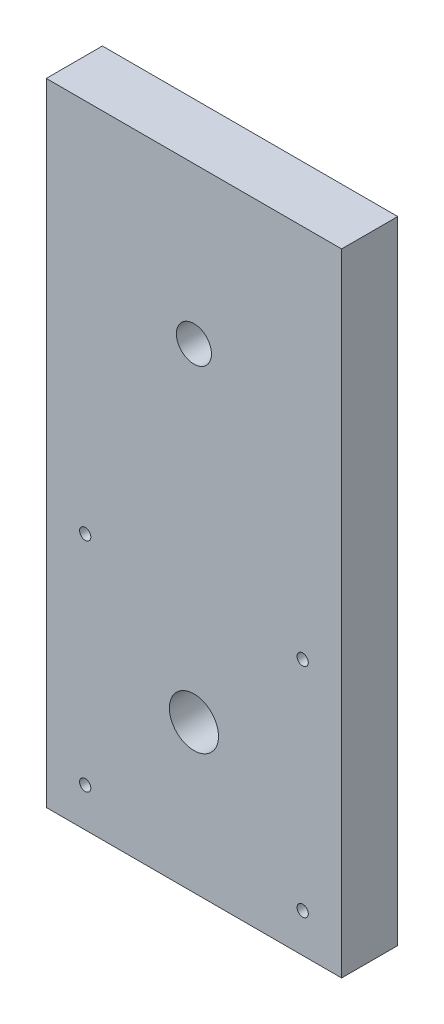
ISO-10303-21;
HEADER;
FILE_DESCRIPTION(('STEP AP214'),'2;1');
FILE_NAME('part.step','',(''),(''),'','','');
FILE_SCHEMA(('AUTOMOTIVE_DESIGN { 1 0 10303 214 1 1 1 1 }'));
ENDSEC;
DATA;
#1=APPLICATION_CONTEXT('core data for automotive mechanical design processes');
#2=APPLICATION_PROTOCOL_DEFINITION('international standard','automotive_design',2000,#1);
#3=PRODUCT_CONTEXT('',#1,'mechanical');
#4=PRODUCT('Part','Part','',(#3));
#5=PRODUCT_RELATED_PRODUCT_CATEGORY('part','',(#4));
#6=PRODUCT_DEFINITION_FORMATION('','',#4);
#7=PRODUCT_DEFINITION_CONTEXT('part definition',#1,'design');
#8=PRODUCT_DEFINITION('design','',#6,#7);
#9=PRODUCT_DEFINITION_SHAPE('','',#8);
#10=(LENGTH_UNIT() NAMED_UNIT(*) SI_UNIT(.MILLI.,.METRE.));
#11=(NAMED_UNIT(*) PLANE_ANGLE_UNIT() SI_UNIT($,.RADIAN.));
#12=(NAMED_UNIT(*) SI_UNIT($,.STERADIAN.) SOLID_ANGLE_UNIT());
#13=UNCERTAINTY_MEASURE_WITH_UNIT(LENGTH_MEASURE(1.E-05),#10,'distance_accuracy_value','');
#14=(GEOMETRIC_REPRESENTATION_CONTEXT(3) GLOBAL_UNCERTAINTY_ASSIGNED_CONTEXT((#13)) GLOBAL_UNIT_ASSIGNED_CONTEXT((#10,
#11,#12)) REPRESENTATION_CONTEXT('',''));
#15=CARTESIAN_POINT('',(0.,0.,0.));
#16=DIRECTION('',(0.,0.,1.));
#17=DIRECTION('',(1.,0.,0.));
#18=AXIS2_PLACEMENT_3D('',#15,#16,#17);
#19=CARTESIAN_POINT('',(0.,0.,0.));
#20=DIRECTION('',(0.,0.,-1.));
#21=DIRECTION('',(-1.,0.,0.));
#22=AXIS2_PLACEMENT_3D('',#19,#20,#21);
#23=PLANE('',#22);
#24=CARTESIAN_POINT('',(0.,46.707876994018,0.));
#25=DIRECTION('',(0.,0.,1.));
#26=DIRECTION('',(1.,0.,0.));
#27=AXIS2_PLACEMENT_3D('',#24,#25,#26);
#28=CIRCLE('',#27,2.5);
#29=CARTESIAN_POINT('',(2.5,46.707876994018,0.));
#30=VERTEX_POINT('',#29);
#31=EDGE_CURVE('E198',#30,#30,#28,.T.);
#32=ORIENTED_EDGE('',*,*,#31,.T.);
#33=EDGE_LOOP('',(#32));
#34=FACE_BOUND('',#33,.T.);
#35=CARTESIAN_POINT('',(-15.5,-15.5,0.));
#36=DIRECTION('',(0.,0.,1.));
#37=DIRECTION('',(1.,0.,0.));
#38=AXIS2_PLACEMENT_3D('',#35,#36,#37);
#39=CIRCLE('',#38,0.799999999999999);
#40=CARTESIAN_POINT('',(-14.7,-15.5,0.));
#41=VERTEX_POINT('',#40);
#42=EDGE_CURVE('E212',#41,#41,#39,.T.);
#43=ORIENTED_EDGE('',*,*,#42,.T.);
#44=EDGE_LOOP('',(#43));
#45=FACE_BOUND('',#44,.T.);
#46=CARTESIAN_POINT('',(15.5,15.5,0.));
#47=DIRECTION('',(0.,0.,1.));
#48=DIRECTION('',(1.,0.,0.));
#49=AXIS2_PLACEMENT_3D('',#46,#47,#48);
#50=CIRCLE('',#49,0.799999999999999);
#51=CARTESIAN_POINT('',(16.3,15.5,0.));
#52=VERTEX_POINT('',#51);
#53=EDGE_CURVE('E219',#52,#52,#50,.T.);
#54=ORIENTED_EDGE('',*,*,#53,.T.);
#55=EDGE_LOOP('',(#54));
#56=FACE_BOUND('',#55,.T.);
#57=CARTESIAN_POINT('',(15.5,-15.5,0.));
#58=DIRECTION('',(0.,0.,1.));
#59=DIRECTION('',(1.,0.,0.));
#60=AXIS2_PLACEMENT_3D('',#57,#58,#59);
#61=CIRCLE('',#60,0.799999999999999);
#62=CARTESIAN_POINT('',(16.3,-15.5,0.));
#63=VERTEX_POINT('',#62);
#64=EDGE_CURVE('E206',#63,#63,#61,.T.);
#65=ORIENTED_EDGE('',*,*,#64,.T.);
#66=EDGE_LOOP('',(#65));
#67=FACE_BOUND('',#66,.T.);
#68=CARTESIAN_POINT('',(-15.5,15.5,0.));
#69=DIRECTION('',(0.,0.,1.));
#70=DIRECTION('',(1.,0.,0.));
#71=AXIS2_PLACEMENT_3D('',#68,#69,#70);
#72=CIRCLE('',#71,0.799999999999999);
#73=CARTESIAN_POINT('',(-14.7,15.5,0.));
#74=VERTEX_POINT('',#73);
#75=EDGE_CURVE('E224',#74,#74,#72,.T.);
#76=ORIENTED_EDGE('',*,*,#75,.T.);
#77=EDGE_LOOP('',(#76));
#78=FACE_BOUND('',#77,.T.);
#79=DIRECTION('',(0.,1.,0.));
#80=VECTOR('',#79,1.);
#81=CARTESIAN_POINT('',(21.05,68.95,0.));
#82=LINE('',#81,#80);
#83=CARTESIAN_POINT('',(21.05,-21.05,0.));
#84=VERTEX_POINT('',#83);
#85=CARTESIAN_POINT('',(21.05,68.95,0.));
#86=VERTEX_POINT('',#85);
#87=EDGE_CURVE('E122',#84,#86,#82,.T.);
#88=ORIENTED_EDGE('',*,*,#87,.F.);
#89=DIRECTION('',(1.,0.,0.));
#90=VECTOR('',#89,1.);
#91=CARTESIAN_POINT('',(21.05,-21.05,0.));
#92=LINE('',#91,#90);
#93=CARTESIAN_POINT('',(-21.05,-21.05,0.));
#94=VERTEX_POINT('',#93);
#95=EDGE_CURVE('E60',#94,#84,#92,.T.);
#96=ORIENTED_EDGE('',*,*,#95,.F.);
#97=DIRECTION('',(0.,-1.,0.));
#98=VECTOR('',#97,1.);
#99=CARTESIAN_POINT('',(-21.05,68.95,0.));
#100=LINE('',#99,#98);
#101=CARTESIAN_POINT('',(-21.05,68.95,0.));
#102=VERTEX_POINT('',#101);
#103=EDGE_CURVE('E68',#102,#94,#100,.T.);
#104=ORIENTED_EDGE('',*,*,#103,.F.);
#105=DIRECTION('',(-1.,0.,0.));
#106=VECTOR('',#105,1.);
#107=CARTESIAN_POINT('',(21.05,68.95,0.));
#108=LINE('',#107,#106);
#109=EDGE_CURVE('E124',#86,#102,#108,.T.);
#110=ORIENTED_EDGE('',*,*,#109,.F.);
#111=EDGE_LOOP('',(#88,#96,#104,#110));
#112=FACE_BOUND('',#111,.T.);
#113=CARTESIAN_POINT('',(0.,0.,0.));
#114=DIRECTION('',(0.,0.,1.));
#115=DIRECTION('',(1.,0.,0.));
#116=AXIS2_PLACEMENT_3D('',#113,#114,#115);
#117=CIRCLE('',#116,11.75);
#118=CARTESIAN_POINT('',(11.75,0.,0.));
#119=VERTEX_POINT('',#118);
#120=EDGE_CURVE('E119',#119,#119,#117,.T.);
#121=ORIENTED_EDGE('',*,*,#120,.T.);
#122=EDGE_LOOP('',(#121));
#123=FACE_BOUND('',#122,.T.);
#124=ADVANCED_FACE('F45',(#34,#45,#56,#67,#78,#112,#123),#23,.T.);
#125=CARTESIAN_POINT('',(21.05,68.95,3.));
#126=DIRECTION('',(-1.,0.,0.));
#127=DIRECTION('',(0.,-1.,0.));
#128=AXIS2_PLACEMENT_3D('',#125,#126,#127);
#129=PLANE('',#128);
#130=ORIENTED_EDGE('',*,*,#87,.T.);
#131=DIRECTION('',(0.,0.,-1.));
#132=VECTOR('',#131,1.);
#133=CARTESIAN_POINT('',(21.05,68.95,3.));
#134=LINE('',#133,#132);
#135=CARTESIAN_POINT('',(21.05,68.95,8.));
#136=VERTEX_POINT('',#135);
#137=EDGE_CURVE('E13',#136,#86,#134,.T.);
#138=ORIENTED_EDGE('',*,*,#137,.F.);
#139=DIRECTION('',(0.,1.,0.));
#140=VECTOR('',#139,1.);
#141=CARTESIAN_POINT('',(21.05,-21.05,8.));
#142=LINE('',#141,#140);
#143=CARTESIAN_POINT('',(21.05,-21.05,8.));
#144=VERTEX_POINT('',#143);
#145=EDGE_CURVE('E96',#144,#136,#142,.T.);
#146=ORIENTED_EDGE('',*,*,#145,.F.);
#147=DIRECTION('',(0.,0.,-1.));
#148=VECTOR('',#147,1.);
#149=CARTESIAN_POINT('',(21.05,-21.05,3.));
#150=LINE('',#149,#148);
#151=EDGE_CURVE('E85',#144,#84,#150,.T.);
#152=ORIENTED_EDGE('',*,*,#151,.T.);
#153=EDGE_LOOP('',(#130,#138,#146,#152));
#154=FACE_BOUND('',#153,.T.);
#155=ADVANCED_FACE('F47',(#154),#129,.F.);
#156=CARTESIAN_POINT('',(21.05,68.95,3.));
#157=DIRECTION('',(0.,-1.,0.));
#158=DIRECTION('',(0.,0.,-1.));
#159=AXIS2_PLACEMENT_3D('',#156,#157,#158);
#160=PLANE('',#159);
#161=ORIENTED_EDGE('',*,*,#109,.T.);
#162=DIRECTION('',(0.,0.,-1.));
#163=VECTOR('',#162,1.);
#164=CARTESIAN_POINT('',(-21.05,68.95,3.));
#165=LINE('',#164,#163);
#166=CARTESIAN_POINT('',(-21.05,68.95,8.));
#167=VERTEX_POINT('',#166);
#168=EDGE_CURVE('E53',#167,#102,#165,.T.);
#169=ORIENTED_EDGE('',*,*,#168,.F.);
#170=DIRECTION('',(-1.,0.,0.));
#171=VECTOR('',#170,1.);
#172=CARTESIAN_POINT('',(21.05,68.95,8.));
#173=LINE('',#172,#171);
#174=EDGE_CURVE('E100',#136,#167,#173,.T.);
#175=ORIENTED_EDGE('',*,*,#174,.F.);
#176=ORIENTED_EDGE('',*,*,#137,.T.);
#177=EDGE_LOOP('',(#161,#169,#175,#176));
#178=FACE_BOUND('',#177,.T.);
#179=ADVANCED_FACE('F132',(#178),#160,.F.);
#180=CARTESIAN_POINT('',(-21.05,68.95,3.));
#181=DIRECTION('',(1.,0.,0.));
#182=DIRECTION('',(0.,1.,0.));
#183=AXIS2_PLACEMENT_3D('',#180,#181,#182);
#184=PLANE('',#183);
#185=ORIENTED_EDGE('',*,*,#103,.T.);
#186=DIRECTION('',(0.,0.,-1.));
#187=VECTOR('',#186,1.);
#188=CARTESIAN_POINT('',(-21.05,-21.05,3.));
#189=LINE('',#188,#187);
#190=CARTESIAN_POINT('',(-21.05,-21.05,8.));
#191=VERTEX_POINT('',#190);
#192=EDGE_CURVE('E93',#191,#94,#189,.T.);
#193=ORIENTED_EDGE('',*,*,#192,.F.);
#194=DIRECTION('',(0.,-1.,0.));
#195=VECTOR('',#194,1.);
#196=CARTESIAN_POINT('',(-21.05,68.95,8.));
#197=LINE('',#196,#195);
#198=EDGE_CURVE('E106',#167,#191,#197,.T.);
#199=ORIENTED_EDGE('',*,*,#198,.F.);
#200=ORIENTED_EDGE('',*,*,#168,.T.);
#201=EDGE_LOOP('',(#185,#193,#199,#200));
#202=FACE_BOUND('',#201,.T.);
#203=ADVANCED_FACE('F128',(#202),#184,.F.);
#204=CARTESIAN_POINT('',(21.05,-21.05,3.));
#205=DIRECTION('',(0.,1.,0.));
#206=DIRECTION('',(-1.,0.,0.));
#207=AXIS2_PLACEMENT_3D('',#204,#205,#206);
#208=PLANE('',#207);
#209=ORIENTED_EDGE('',*,*,#95,.T.);
#210=ORIENTED_EDGE('',*,*,#151,.F.);
#211=DIRECTION('',(1.,0.,0.));
#212=VECTOR('',#211,1.);
#213=CARTESIAN_POINT('',(-21.05,-21.05,8.));
#214=LINE('',#213,#212);
#215=EDGE_CURVE('E89',#191,#144,#214,.T.);
#216=ORIENTED_EDGE('',*,*,#215,.F.);
#217=ORIENTED_EDGE('',*,*,#192,.T.);
#218=EDGE_LOOP('',(#209,#210,#216,#217));
#219=FACE_BOUND('',#218,.T.);
#220=ADVANCED_FACE('F87',(#219),#208,.F.);
#221=CARTESIAN_POINT('',(0.,0.,3.));
#222=DIRECTION('',(0.,0.,-1.));
#223=DIRECTION('',(-1.,0.,0.));
#224=AXIS2_PLACEMENT_3D('',#221,#222,#223);
#225=CYLINDRICAL_SURFACE('',#224,11.75);
#226=CARTESIAN_POINT('',(0.,0.,3.));
#227=DIRECTION('',(0.,0.,1.));
#228=DIRECTION('',(1.,0.,0.));
#229=AXIS2_PLACEMENT_3D('',#226,#227,#228);
#230=CIRCLE('',#229,11.75);
#231=CARTESIAN_POINT('',(11.75,0.,3.));
#232=VERTEX_POINT('',#231);
#233=EDGE_CURVE('E116',#232,#232,#230,.T.);
#234=ORIENTED_EDGE('',*,*,#233,.T.);
#235=EDGE_LOOP('',(#234));
#236=FACE_BOUND('',#235,.T.);
#237=ORIENTED_EDGE('',*,*,#120,.F.);
#238=EDGE_LOOP('',(#237));
#239=FACE_BOUND('',#238,.T.);
#240=ADVANCED_FACE('F148',(#236,#239),#225,.F.);
#241=CARTESIAN_POINT('',(0.,0.,3.));
#242=DIRECTION('',(0.,0.,1.));
#243=DIRECTION('',(1.,0.,0.));
#244=AXIS2_PLACEMENT_3D('',#241,#242,#243);
#245=PLANE('',#244);
#246=CARTESIAN_POINT('',(0.,0.,3.));
#247=DIRECTION('',(0.,0.,1.));
#248=DIRECTION('',(1.,0.,0.));
#249=AXIS2_PLACEMENT_3D('',#246,#247,#248);
#250=CIRCLE('',#249,3.5);
#251=CARTESIAN_POINT('',(3.5,0.,3.));
#252=VERTEX_POINT('',#251);
#253=EDGE_CURVE('E110',#252,#252,#250,.T.);
#254=ORIENTED_EDGE('',*,*,#253,.T.);
#255=EDGE_LOOP('',(#254));
#256=FACE_BOUND('',#255,.T.);
#257=ORIENTED_EDGE('',*,*,#233,.F.);
#258=EDGE_LOOP('',(#257));
#259=FACE_BOUND('',#258,.T.);
#260=ADVANCED_FACE('F154',(#256,#259),#245,.F.);
#261=CARTESIAN_POINT('',(0.,0.,8.));
#262=DIRECTION('',(0.,0.,1.));
#263=DIRECTION('',(1.,0.,0.));
#264=AXIS2_PLACEMENT_3D('',#261,#262,#263);
#265=PLANE('',#264);
#266=CARTESIAN_POINT('',(0.,46.707876994018,8.));
#267=DIRECTION('',(0.,0.,1.));
#268=DIRECTION('',(1.,0.,0.));
#269=AXIS2_PLACEMENT_3D('',#266,#267,#268);
#270=CIRCLE('',#269,2.5);
#271=CARTESIAN_POINT('',(2.5,46.707876994018,8.));
#272=VERTEX_POINT('',#271);
#273=EDGE_CURVE('E201',#272,#272,#270,.T.);
#274=ORIENTED_EDGE('',*,*,#273,.F.);
#275=EDGE_LOOP('',(#274));
#276=FACE_BOUND('',#275,.T.);
#277=CARTESIAN_POINT('',(-15.5,-15.5,8.));
#278=DIRECTION('',(0.,0.,1.));
#279=DIRECTION('',(1.,0.,0.));
#280=AXIS2_PLACEMENT_3D('',#277,#278,#279);
#281=CIRCLE('',#280,0.799999999999999);
#282=CARTESIAN_POINT('',(-14.7,-15.5,8.));
#283=VERTEX_POINT('',#282);
#284=EDGE_CURVE('E216',#283,#283,#281,.T.);
#285=ORIENTED_EDGE('',*,*,#284,.F.);
#286=EDGE_LOOP('',(#285));
#287=FACE_BOUND('',#286,.T.);
#288=CARTESIAN_POINT('',(15.5,15.5,8.));
#289=DIRECTION('',(0.,0.,1.));
#290=DIRECTION('',(1.,0.,0.));
#291=AXIS2_PLACEMENT_3D('',#288,#289,#290);
#292=CIRCLE('',#291,0.799999999999999);
#293=CARTESIAN_POINT('',(16.3,15.5,8.));
#294=VERTEX_POINT('',#293);
#295=EDGE_CURVE('E209',#294,#294,#292,.T.);
#296=ORIENTED_EDGE('',*,*,#295,.F.);
#297=EDGE_LOOP('',(#296));
#298=FACE_BOUND('',#297,.T.);
#299=CARTESIAN_POINT('',(15.5,-15.5,8.));
#300=DIRECTION('',(0.,0.,1.));
#301=DIRECTION('',(1.,0.,0.));
#302=AXIS2_PLACEMENT_3D('',#299,#300,#301);
#303=CIRCLE('',#302,0.799999999999999);
#304=CARTESIAN_POINT('',(16.3,-15.5,8.));
#305=VERTEX_POINT('',#304);
#306=EDGE_CURVE('E203',#305,#305,#303,.T.);
#307=ORIENTED_EDGE('',*,*,#306,.F.);
#308=EDGE_LOOP('',(#307));
#309=FACE_BOUND('',#308,.T.);
#310=CARTESIAN_POINT('',(-15.5,15.5,8.));
#311=DIRECTION('',(0.,0.,1.));
#312=DIRECTION('',(1.,0.,0.));
#313=AXIS2_PLACEMENT_3D('',#310,#311,#312);
#314=CIRCLE('',#313,0.799999999999999);
#315=CARTESIAN_POINT('',(-14.7,15.5,8.));
#316=VERTEX_POINT('',#315);
#317=EDGE_CURVE('E215',#316,#316,#314,.T.);
#318=ORIENTED_EDGE('',*,*,#317,.F.);
#319=EDGE_LOOP('',(#318));
#320=FACE_BOUND('',#319,.T.);
#321=ORIENTED_EDGE('',*,*,#215,.T.);
#322=ORIENTED_EDGE('',*,*,#145,.T.);
#323=ORIENTED_EDGE('',*,*,#174,.T.);
#324=ORIENTED_EDGE('',*,*,#198,.T.);
#325=EDGE_LOOP('',(#321,#322,#323,#324));
#326=FACE_BOUND('',#325,.T.);
#327=CARTESIAN_POINT('',(0.,0.,8.));
#328=DIRECTION('',(0.,0.,1.));
#329=DIRECTION('',(1.,0.,0.));
#330=AXIS2_PLACEMENT_3D('',#327,#328,#329);
#331=CIRCLE('',#330,3.5);
#332=CARTESIAN_POINT('',(3.5,0.,8.));
#333=VERTEX_POINT('',#332);
#334=EDGE_CURVE('E107',#333,#333,#331,.T.);
#335=ORIENTED_EDGE('',*,*,#334,.F.);
#336=EDGE_LOOP('',(#335));
#337=FACE_BOUND('',#336,.T.);
#338=ADVANCED_FACE('F103',(#276,#287,#298,#309,#320,#326,#337),#265,.T.);
#339=CARTESIAN_POINT('',(0.,0.,8.));
#340=DIRECTION('',(0.,0.,-1.));
#341=DIRECTION('',(-1.,0.,0.));
#342=AXIS2_PLACEMENT_3D('',#339,#340,#341);
#343=CYLINDRICAL_SURFACE('',#342,3.5);
#344=ORIENTED_EDGE('',*,*,#334,.T.);
#345=EDGE_LOOP('',(#344));
#346=FACE_BOUND('',#345,.T.);
#347=ORIENTED_EDGE('',*,*,#253,.F.);
#348=EDGE_LOOP('',(#347));
#349=FACE_BOUND('',#348,.T.);
#350=ADVANCED_FACE('F167',(#346,#349),#343,.F.);
#351=CARTESIAN_POINT('',(-15.5,15.5,0.));
#352=DIRECTION('',(0.,0.,1.));
#353=DIRECTION('',(1.,0.,0.));
#354=AXIS2_PLACEMENT_3D('',#351,#352,#353);
#355=CYLINDRICAL_SURFACE('',#354,0.799999999999999);
#356=ORIENTED_EDGE('',*,*,#75,.F.);
#357=EDGE_LOOP('',(#356));
#358=FACE_BOUND('',#357,.T.);
#359=ORIENTED_EDGE('',*,*,#317,.T.);
#360=EDGE_LOOP('',(#359));
#361=FACE_BOUND('',#360,.T.);
#362=ADVANCED_FACE('F174',(#358,#361),#355,.F.);
#363=CARTESIAN_POINT('',(15.5,-15.5,0.));
#364=DIRECTION('',(0.,0.,1.));
#365=DIRECTION('',(1.,0.,0.));
#366=AXIS2_PLACEMENT_3D('',#363,#364,#365);
#367=CYLINDRICAL_SURFACE('',#366,0.799999999999999);
#368=ORIENTED_EDGE('',*,*,#64,.F.);
#369=EDGE_LOOP('',(#368));
#370=FACE_BOUND('',#369,.T.);
#371=ORIENTED_EDGE('',*,*,#306,.T.);
#372=EDGE_LOOP('',(#371));
#373=FACE_BOUND('',#372,.T.);
#374=ADVANCED_FACE('F178',(#370,#373),#367,.F.);
#375=CARTESIAN_POINT('',(15.5,15.5,0.));
#376=DIRECTION('',(0.,0.,1.));
#377=DIRECTION('',(1.,0.,0.));
#378=AXIS2_PLACEMENT_3D('',#375,#376,#377);
#379=CYLINDRICAL_SURFACE('',#378,0.799999999999999);
#380=ORIENTED_EDGE('',*,*,#53,.F.);
#381=EDGE_LOOP('',(#380));
#382=FACE_BOUND('',#381,.T.);
#383=ORIENTED_EDGE('',*,*,#295,.T.);
#384=EDGE_LOOP('',(#383));
#385=FACE_BOUND('',#384,.T.);
#386=ADVANCED_FACE('F180',(#382,#385),#379,.F.);
#387=CARTESIAN_POINT('',(-15.5,-15.5,0.));
#388=DIRECTION('',(0.,0.,1.));
#389=DIRECTION('',(1.,0.,0.));
#390=AXIS2_PLACEMENT_3D('',#387,#388,#389);
#391=CYLINDRICAL_SURFACE('',#390,0.799999999999999);
#392=ORIENTED_EDGE('',*,*,#42,.F.);
#393=EDGE_LOOP('',(#392));
#394=FACE_BOUND('',#393,.T.);
#395=ORIENTED_EDGE('',*,*,#284,.T.);
#396=EDGE_LOOP('',(#395));
#397=FACE_BOUND('',#396,.T.);
#398=ADVANCED_FACE('F183',(#394,#397),#391,.F.);
#399=CARTESIAN_POINT('',(0.,46.707876994018,0.));
#400=DIRECTION('',(0.,0.,1.));
#401=DIRECTION('',(1.,0.,0.));
#402=AXIS2_PLACEMENT_3D('',#399,#400,#401);
#403=CYLINDRICAL_SURFACE('',#402,2.5);
#404=ORIENTED_EDGE('',*,*,#31,.F.);
#405=EDGE_LOOP('',(#404));
#406=FACE_BOUND('',#405,.T.);
#407=ORIENTED_EDGE('',*,*,#273,.T.);
#408=EDGE_LOOP('',(#407));
#409=FACE_BOUND('',#408,.T.);
#410=ADVANCED_FACE('F187',(#406,#409),#403,.F.);
#411=CLOSED_SHELL('',(#124,#155,#179,#203,#220,#240,#260,#338,#350,#362,#374,#386,#398,#410));
#412=MANIFOLD_SOLID_BREP('B2',#411);
#413=ADVANCED_BREP_SHAPE_REPRESENTATION('',(#18,#412),#14);
#414=SHAPE_DEFINITION_REPRESENTATION(#9,#413);
ENDSEC;
END-ISO-10303-21;
